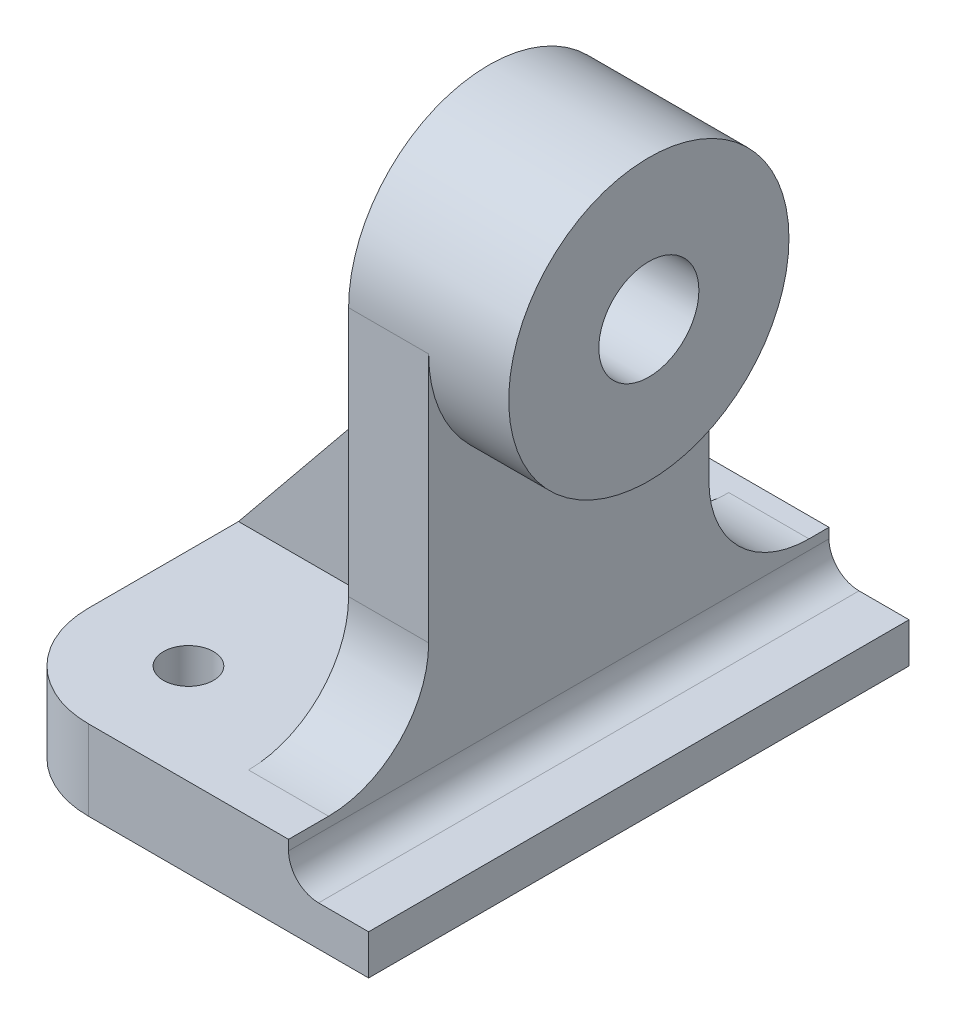
ISO-10303-21;
HEADER;
FILE_DESCRIPTION(('STEP AP214'),'2;1');
FILE_NAME('part.step','',(''),(''),'','','');
FILE_SCHEMA(('AUTOMOTIVE_DESIGN { 1 0 10303 214 1 1 1 1 }'));
ENDSEC;
DATA;
#1=APPLICATION_CONTEXT('core data for automotive mechanical design processes');
#2=APPLICATION_PROTOCOL_DEFINITION('international standard','automotive_design',2000,#1);
#3=PRODUCT_CONTEXT('',#1,'mechanical');
#4=PRODUCT('Part','Part','',(#3));
#5=PRODUCT_RELATED_PRODUCT_CATEGORY('part','',(#4));
#6=PRODUCT_DEFINITION_FORMATION('','',#4);
#7=PRODUCT_DEFINITION_CONTEXT('part definition',#1,'design');
#8=PRODUCT_DEFINITION('design','',#6,#7);
#9=PRODUCT_DEFINITION_SHAPE('','',#8);
#10=(LENGTH_UNIT() NAMED_UNIT(*) SI_UNIT(.MILLI.,.METRE.));
#11=(NAMED_UNIT(*) PLANE_ANGLE_UNIT() SI_UNIT($,.RADIAN.));
#12=(NAMED_UNIT(*) SI_UNIT($,.STERADIAN.) SOLID_ANGLE_UNIT());
#13=UNCERTAINTY_MEASURE_WITH_UNIT(LENGTH_MEASURE(1.E-05),#10,'distance_accuracy_value','');
#14=(GEOMETRIC_REPRESENTATION_CONTEXT(3) GLOBAL_UNCERTAINTY_ASSIGNED_CONTEXT((#13)) GLOBAL_UNIT_ASSIGNED_CONTEXT((#10,
#11,#12)) REPRESENTATION_CONTEXT('',''));
#15=CARTESIAN_POINT('',(0.,0.,0.));
#16=DIRECTION('',(0.,0.,1.));
#17=DIRECTION('',(1.,0.,0.));
#18=AXIS2_PLACEMENT_3D('',#15,#16,#17);
#19=CARTESIAN_POINT('',(0.,8.,0.));
#20=DIRECTION('',(0.,1.,0.));
#21=DIRECTION('',(0.,0.,1.));
#22=AXIS2_PLACEMENT_3D('',#19,#20,#21);
#23=PLANE('',#22);
#24=CARTESIAN_POINT('',(-28.,8.,-44.));
#25=DIRECTION('',(0.,1.,0.));
#26=DIRECTION('',(0.,0.,1.));
#27=AXIS2_PLACEMENT_3D('',#24,#25,#26);
#28=CIRCLE('',#27,2.5);
#29=CARTESIAN_POINT('',(-28.,8.,-41.5));
#30=VERTEX_POINT('',#29);
#31=EDGE_CURVE('E258',#30,#30,#28,.T.);
#32=ORIENTED_EDGE('',*,*,#31,.F.);
#33=EDGE_LOOP('',(#32));
#34=FACE_BOUND('',#33,.T.);
#35=DIRECTION('',(0.,0.,1.));
#36=VECTOR('',#35,1.);
#37=CARTESIAN_POINT('',(-38.,8.,0.));
#38=LINE('',#37,#36);
#39=CARTESIAN_POINT('',(-38.,8.,-44.));
#40=VERTEX_POINT('',#39);
#41=CARTESIAN_POINT('',(-38.,8.,-31.));
#42=VERTEX_POINT('',#41);
#43=EDGE_CURVE('E187',#40,#42,#38,.T.);
#44=ORIENTED_EDGE('',*,*,#43,.T.);
#45=DIRECTION('',(1.,0.,0.));
#46=VECTOR('',#45,1.);
#47=CARTESIAN_POINT('',(0.,8.,-31.));
#48=LINE('',#47,#46);
#49=CARTESIAN_POINT('',(-16.,8.,-31.));
#50=VERTEX_POINT('',#49);
#51=EDGE_CURVE('E186',#42,#50,#48,.T.);
#52=ORIENTED_EDGE('',*,*,#51,.T.);
#53=DIRECTION('',(0.,0.,-1.));
#54=VECTOR('',#53,1.);
#55=CARTESIAN_POINT('',(-16.,8.,-14.));
#56=LINE('',#55,#54);
#57=CARTESIAN_POINT('',(-16.,8.,-52.));
#58=VERTEX_POINT('',#57);
#59=EDGE_CURVE('E169',#50,#58,#56,.T.);
#60=ORIENTED_EDGE('',*,*,#59,.T.);
#61=DIRECTION('',(1.,0.,0.));
#62=VECTOR('',#61,1.);
#63=CARTESIAN_POINT('',(-8.,8.,-52.));
#64=LINE('',#63,#62);
#65=CARTESIAN_POINT('',(-8.,8.,-52.));
#66=VERTEX_POINT('',#65);
#67=EDGE_CURVE('E367',#58,#66,#64,.T.);
#68=ORIENTED_EDGE('',*,*,#67,.T.);
#69=DIRECTION('',(0.,0.,1.));
#70=VECTOR('',#69,1.);
#71=CARTESIAN_POINT('',(-8.,8.,-54.));
#72=LINE('',#71,#70);
#73=CARTESIAN_POINT('',(-8.,8.,-54.));
#74=VERTEX_POINT('',#73);
#75=EDGE_CURVE('E284',#74,#66,#72,.T.);
#76=ORIENTED_EDGE('',*,*,#75,.F.);
#77=DIRECTION('',(-1.,0.,0.));
#78=VECTOR('',#77,1.);
#79=CARTESIAN_POINT('',(0.,8.,-54.));
#80=LINE('',#79,#78);
#81=CARTESIAN_POINT('',(-28.,8.,-54.));
#82=VERTEX_POINT('',#81);
#83=EDGE_CURVE('E292',#74,#82,#80,.T.);
#84=ORIENTED_EDGE('',*,*,#83,.T.);
#85=CARTESIAN_POINT('',(-28.,8.,-44.));
#86=DIRECTION('',(0.,1.,0.));
#87=DIRECTION('',(0.,0.,1.));
#88=AXIS2_PLACEMENT_3D('',#85,#86,#87);
#89=CIRCLE('',#88,10.);
#90=EDGE_CURVE('E356',#82,#40,#89,.T.);
#91=ORIENTED_EDGE('',*,*,#90,.T.);
#92=EDGE_LOOP('',(#44,#52,#60,#68,#76,#84,#91));
#93=FACE_BOUND('',#92,.T.);
#94=ADVANCED_FACE('F43',(#34,#93),#23,.T.);
#95=CARTESIAN_POINT('',(-8.,4.,-54.));
#96=DIRECTION('',(1.,0.,0.));
#97=DIRECTION('',(0.,0.,-1.));
#98=AXIS2_PLACEMENT_3D('',#95,#96,#97);
#99=PLANE('',#98);
#100=DIRECTION('',(0.,0.,1.));
#101=VECTOR('',#100,1.);
#102=CARTESIAN_POINT('',(-8.,7.,-54.));
#103=LINE('',#102,#101);
#104=CARTESIAN_POINT('',(-8.,7.,0.));
#105=VERTEX_POINT('',#104);
#106=CARTESIAN_POINT('',(-8.,7.,-54.));
#107=VERTEX_POINT('',#106);
#108=EDGE_CURVE('E326',#105,#107,#103,.F.);
#109=ORIENTED_EDGE('',*,*,#108,.T.);
#110=DIRECTION('',(0.,1.,0.));
#111=VECTOR('',#110,1.);
#112=CARTESIAN_POINT('',(-8.,4.,-54.));
#113=LINE('',#112,#111);
#114=EDGE_CURVE('E273',#107,#74,#113,.T.);
#115=ORIENTED_EDGE('',*,*,#114,.T.);
#116=ORIENTED_EDGE('',*,*,#75,.T.);
#117=CARTESIAN_POINT('',(-8.,18.,-52.));
#118=DIRECTION('',(1.,0.,0.));
#119=DIRECTION('',(0.,0.,-1.));
#120=AXIS2_PLACEMENT_3D('',#117,#118,#119);
#121=CIRCLE('',#120,10.);
#122=CARTESIAN_POINT('',(-8.,18.,-42.));
#123=VERTEX_POINT('',#122);
#124=EDGE_CURVE('E377',#66,#123,#121,.F.);
#125=ORIENTED_EDGE('',*,*,#124,.T.);
#126=DIRECTION('',(0.,1.,0.));
#127=VECTOR('',#126,1.);
#128=CARTESIAN_POINT('',(-8.,43.,-42.));
#129=LINE('',#128,#127);
#130=CARTESIAN_POINT('',(-8.,43.,-42.));
#131=VERTEX_POINT('',#130);
#132=EDGE_CURVE('E230',#123,#131,#129,.T.);
#133=ORIENTED_EDGE('',*,*,#132,.T.);
#134=CARTESIAN_POINT('',(-8.,43.,-28.));
#135=DIRECTION('',(1.,0.,0.));
#136=DIRECTION('',(0.,0.,-1.));
#137=AXIS2_PLACEMENT_3D('',#134,#135,#136);
#138=CIRCLE('',#137,14.);
#139=CARTESIAN_POINT('',(-8.,43.,-14.));
#140=VERTEX_POINT('',#139);
#141=EDGE_CURVE('E218',#140,#131,#138,.T.);
#142=ORIENTED_EDGE('',*,*,#141,.F.);
#143=DIRECTION('',(0.,-1.,0.));
#144=VECTOR('',#143,1.);
#145=CARTESIAN_POINT('',(-8.,43.,-14.));
#146=LINE('',#145,#144);
#147=CARTESIAN_POINT('',(-8.,18.,-14.));
#148=VERTEX_POINT('',#147);
#149=EDGE_CURVE('E223',#140,#148,#146,.T.);
#150=ORIENTED_EDGE('',*,*,#149,.T.);
#151=CARTESIAN_POINT('',(-8.,18.,-4.));
#152=DIRECTION('',(1.,0.,0.));
#153=DIRECTION('',(0.,0.,-1.));
#154=AXIS2_PLACEMENT_3D('',#151,#152,#153);
#155=CIRCLE('',#154,10.);
#156=CARTESIAN_POINT('',(-8.,8.,-4.));
#157=VERTEX_POINT('',#156);
#158=EDGE_CURVE('E52',#148,#157,#155,.F.);
#159=ORIENTED_EDGE('',*,*,#158,.T.);
#160=CARTESIAN_POINT('',(-8.,8.,0.));
#161=VERTEX_POINT('',#160);
#162=EDGE_CURVE('E277',#157,#161,#72,.T.);
#163=ORIENTED_EDGE('',*,*,#162,.T.);
#164=DIRECTION('',(0.,1.,0.));
#165=VECTOR('',#164,1.);
#166=CARTESIAN_POINT('',(-8.,4.,0.));
#167=LINE('',#166,#165);
#168=EDGE_CURVE('E274',#105,#161,#167,.T.);
#169=ORIENTED_EDGE('',*,*,#168,.F.);
#170=EDGE_LOOP('',(#109,#115,#116,#125,#133,#142,#150,#159,#163,#169));
#171=FACE_BOUND('',#170,.T.);
#172=ADVANCED_FACE('F384',(#171),#99,.T.);
#173=CARTESIAN_POINT('',(0.,8.,0.));
#174=DIRECTION('',(-1.,0.,0.));
#175=DIRECTION('',(0.,0.,1.));
#176=AXIS2_PLACEMENT_3D('',#173,#174,#175);
#177=PLANE('',#176);
#178=DIRECTION('',(0.,0.,-1.));
#179=VECTOR('',#178,1.);
#180=CARTESIAN_POINT('',(0.,0.,0.));
#181=LINE('',#180,#179);
#182=CARTESIAN_POINT('',(0.,0.,0.));
#183=VERTEX_POINT('',#182);
#184=CARTESIAN_POINT('',(0.,0.,-54.));
#185=VERTEX_POINT('',#184);
#186=EDGE_CURVE('E291',#183,#185,#181,.T.);
#187=ORIENTED_EDGE('',*,*,#186,.T.);
#188=DIRECTION('',(0.,-1.,0.));
#189=VECTOR('',#188,1.);
#190=CARTESIAN_POINT('',(0.,8.,-54.));
#191=LINE('',#190,#189);
#192=CARTESIAN_POINT('',(0.,4.,-54.));
#193=VERTEX_POINT('',#192);
#194=EDGE_CURVE('E319',#193,#185,#191,.T.);
#195=ORIENTED_EDGE('',*,*,#194,.F.);
#196=DIRECTION('',(0.,0.,1.));
#197=VECTOR('',#196,1.);
#198=CARTESIAN_POINT('',(0.,4.,-54.));
#199=LINE('',#198,#197);
#200=CARTESIAN_POINT('',(0.,4.,0.));
#201=VERTEX_POINT('',#200);
#202=EDGE_CURVE('E288',#193,#201,#199,.T.);
#203=ORIENTED_EDGE('',*,*,#202,.T.);
#204=DIRECTION('',(0.,-1.,0.));
#205=VECTOR('',#204,1.);
#206=CARTESIAN_POINT('',(0.,8.,0.));
#207=LINE('',#206,#205);
#208=EDGE_CURVE('E304',#201,#183,#207,.T.);
#209=ORIENTED_EDGE('',*,*,#208,.T.);
#210=EDGE_LOOP('',(#187,#195,#203,#209));
#211=FACE_BOUND('',#210,.T.);
#212=ADVANCED_FACE('F428',(#211),#177,.F.);
#213=CARTESIAN_POINT('',(0.,8.,-54.));
#214=DIRECTION('',(0.,0.,1.));
#215=DIRECTION('',(1.,0.,0.));
#216=AXIS2_PLACEMENT_3D('',#213,#214,#215);
#217=PLANE('',#216);
#218=DIRECTION('',(-1.,0.,0.));
#219=VECTOR('',#218,1.);
#220=CARTESIAN_POINT('',(0.,0.,-54.));
#221=LINE('',#220,#219);
#222=CARTESIAN_POINT('',(-28.,0.,-54.));
#223=VERTEX_POINT('',#222);
#224=EDGE_CURVE('E307',#185,#223,#221,.T.);
#225=ORIENTED_EDGE('',*,*,#224,.T.);
#226=DIRECTION('',(0.,-1.,0.));
#227=VECTOR('',#226,1.);
#228=CARTESIAN_POINT('',(-28.,8.,-54.));
#229=LINE('',#228,#227);
#230=EDGE_CURVE('E350',#223,#82,#229,.F.);
#231=ORIENTED_EDGE('',*,*,#230,.T.);
#232=ORIENTED_EDGE('',*,*,#83,.F.);
#233=ORIENTED_EDGE('',*,*,#114,.F.);
#234=CARTESIAN_POINT('',(-5.,7.,-54.));
#235=DIRECTION('',(0.,0.,1.));
#236=DIRECTION('',(1.,0.,0.));
#237=AXIS2_PLACEMENT_3D('',#234,#235,#236);
#238=CIRCLE('',#237,3.);
#239=CARTESIAN_POINT('',(-5.,4.,-54.));
#240=VERTEX_POINT('',#239);
#241=EDGE_CURVE('E332',#107,#240,#238,.T.);
#242=ORIENTED_EDGE('',*,*,#241,.T.);
#243=DIRECTION('',(-1.,0.,0.));
#244=VECTOR('',#243,1.);
#245=CARTESIAN_POINT('',(0.,4.,-54.));
#246=LINE('',#245,#244);
#247=EDGE_CURVE('E269',#193,#240,#246,.T.);
#248=ORIENTED_EDGE('',*,*,#247,.F.);
#249=ORIENTED_EDGE('',*,*,#194,.T.);
#250=EDGE_LOOP('',(#225,#231,#232,#233,#242,#248,#249));
#251=FACE_BOUND('',#250,.T.);
#252=ADVANCED_FACE('F415',(#251),#217,.F.);
#253=CARTESIAN_POINT('',(0.,8.,0.));
#254=DIRECTION('',(0.,0.,-1.));
#255=DIRECTION('',(-1.,0.,0.));
#256=AXIS2_PLACEMENT_3D('',#253,#254,#255);
#257=PLANE('',#256);
#258=DIRECTION('',(1.,0.,0.));
#259=VECTOR('',#258,1.);
#260=CARTESIAN_POINT('',(0.,8.,0.));
#261=LINE('',#260,#259);
#262=CARTESIAN_POINT('',(-28.,8.,0.));
#263=VERTEX_POINT('',#262);
#264=EDGE_CURVE('E300',#263,#161,#261,.T.);
#265=ORIENTED_EDGE('',*,*,#264,.F.);
#266=DIRECTION('',(0.,-1.,0.));
#267=VECTOR('',#266,1.);
#268=CARTESIAN_POINT('',(-28.,8.,0.));
#269=LINE('',#268,#267);
#270=CARTESIAN_POINT('',(-28.,0.,0.));
#271=VERTEX_POINT('',#270);
#272=EDGE_CURVE('E359',#263,#271,#269,.T.);
#273=ORIENTED_EDGE('',*,*,#272,.T.);
#274=DIRECTION('',(1.,0.,0.));
#275=VECTOR('',#274,1.);
#276=CARTESIAN_POINT('',(0.,0.,0.));
#277=LINE('',#276,#275);
#278=EDGE_CURVE('E297',#271,#183,#277,.T.);
#279=ORIENTED_EDGE('',*,*,#278,.T.);
#280=ORIENTED_EDGE('',*,*,#208,.F.);
#281=DIRECTION('',(-1.,0.,0.));
#282=VECTOR('',#281,1.);
#283=CARTESIAN_POINT('',(0.,4.,0.));
#284=LINE('',#283,#282);
#285=CARTESIAN_POINT('',(-5.,4.,0.));
#286=VERTEX_POINT('',#285);
#287=EDGE_CURVE('E257',#201,#286,#284,.T.);
#288=ORIENTED_EDGE('',*,*,#287,.T.);
#289=CARTESIAN_POINT('',(-5.,7.,0.));
#290=DIRECTION('',(0.,0.,-1.));
#291=DIRECTION('',(-1.,0.,0.));
#292=AXIS2_PLACEMENT_3D('',#289,#290,#291);
#293=CIRCLE('',#292,3.);
#294=EDGE_CURVE('E329',#286,#105,#293,.T.);
#295=ORIENTED_EDGE('',*,*,#294,.T.);
#296=ORIENTED_EDGE('',*,*,#168,.T.);
#297=EDGE_LOOP('',(#265,#273,#279,#280,#288,#295,#296));
#298=FACE_BOUND('',#297,.T.);
#299=ADVANCED_FACE('F477',(#298),#257,.F.);
#300=DIRECTION('',(1.,0.,0.));
#301=VECTOR('',#300,1.);
#302=CARTESIAN_POINT('',(0.,8.,-25.));
#303=LINE('',#302,#301);
#304=CARTESIAN_POINT('',(-38.,8.,-25.));
#305=VERTEX_POINT('',#304);
#306=CARTESIAN_POINT('',(-16.,8.,-25.));
#307=VERTEX_POINT('',#306);
#308=EDGE_CURVE('E59',#305,#307,#303,.T.);
#309=ORIENTED_EDGE('',*,*,#308,.F.);
#310=CARTESIAN_POINT('',(-38.,8.,-10.));
#311=VERTEX_POINT('',#310);
#312=EDGE_CURVE('E296',#305,#311,#38,.T.);
#313=ORIENTED_EDGE('',*,*,#312,.T.);
#314=CARTESIAN_POINT('',(-28.,8.,-10.));
#315=DIRECTION('',(0.,1.,0.));
#316=DIRECTION('',(0.,0.,1.));
#317=AXIS2_PLACEMENT_3D('',#314,#315,#316);
#318=CIRCLE('',#317,10.);
#319=EDGE_CURVE('E353',#311,#263,#318,.T.);
#320=ORIENTED_EDGE('',*,*,#319,.T.);
#321=ORIENTED_EDGE('',*,*,#264,.T.);
#322=ORIENTED_EDGE('',*,*,#162,.F.);
#323=DIRECTION('',(1.,0.,0.));
#324=VECTOR('',#323,1.);
#325=CARTESIAN_POINT('',(-16.,8.,-4.));
#326=LINE('',#325,#324);
#327=CARTESIAN_POINT('',(-16.,8.,-4.));
#328=VERTEX_POINT('',#327);
#329=EDGE_CURVE('E363',#157,#328,#326,.F.);
#330=ORIENTED_EDGE('',*,*,#329,.T.);
#331=EDGE_CURVE('E182',#328,#307,#56,.T.);
#332=ORIENTED_EDGE('',*,*,#331,.T.);
#333=EDGE_LOOP('',(#309,#313,#320,#321,#322,#330,#332));
#334=FACE_BOUND('',#333,.T.);
#335=CARTESIAN_POINT('',(-28.,8.,-10.));
#336=DIRECTION('',(0.,1.,0.));
#337=DIRECTION('',(0.,0.,1.));
#338=AXIS2_PLACEMENT_3D('',#335,#336,#337);
#339=CIRCLE('',#338,2.5);
#340=CARTESIAN_POINT('',(-28.,8.,-7.5));
#341=VERTEX_POINT('',#340);
#342=EDGE_CURVE('E262',#341,#341,#339,.T.);
#343=ORIENTED_EDGE('',*,*,#342,.F.);
#344=EDGE_LOOP('',(#343));
#345=FACE_BOUND('',#344,.T.);
#346=ADVANCED_FACE('F390',(#334,#345),#23,.T.);
#347=CARTESIAN_POINT('',(-38.,8.,0.));
#348=DIRECTION('',(1.,0.,0.));
#349=DIRECTION('',(0.,0.,-1.));
#350=AXIS2_PLACEMENT_3D('',#347,#348,#349);
#351=PLANE('',#350);
#352=ORIENTED_EDGE('',*,*,#312,.F.);
#353=DIRECTION('',(0.,0.,-1.));
#354=VECTOR('',#353,1.);
#355=CARTESIAN_POINT('',(-38.,8.,0.));
#356=LINE('',#355,#354);
#357=EDGE_CURVE('E66',#42,#305,#356,.F.);
#358=ORIENTED_EDGE('',*,*,#357,.F.);
#359=ORIENTED_EDGE('',*,*,#43,.F.);
#360=DIRECTION('',(0.,-1.,0.));
#361=VECTOR('',#360,1.);
#362=CARTESIAN_POINT('',(-38.,8.,-44.));
#363=LINE('',#362,#361);
#364=CARTESIAN_POINT('',(-38.,0.,-44.));
#365=VERTEX_POINT('',#364);
#366=EDGE_CURVE('E339',#40,#365,#363,.T.);
#367=ORIENTED_EDGE('',*,*,#366,.T.);
#368=DIRECTION('',(0.,0.,1.));
#369=VECTOR('',#368,1.);
#370=CARTESIAN_POINT('',(-38.,0.,0.));
#371=LINE('',#370,#369);
#372=CARTESIAN_POINT('',(-38.,0.,-10.));
#373=VERTEX_POINT('',#372);
#374=EDGE_CURVE('E311',#365,#373,#371,.T.);
#375=ORIENTED_EDGE('',*,*,#374,.T.);
#376=DIRECTION('',(0.,-1.,0.));
#377=VECTOR('',#376,1.);
#378=CARTESIAN_POINT('',(-38.,8.,-10.));
#379=LINE('',#378,#377);
#380=EDGE_CURVE('E335',#373,#311,#379,.F.);
#381=ORIENTED_EDGE('',*,*,#380,.T.);
#382=EDGE_LOOP('',(#352,#358,#359,#367,#375,#381));
#383=FACE_BOUND('',#382,.T.);
#384=ADVANCED_FACE('F440',(#383),#351,.F.);
#385=CARTESIAN_POINT('',(0.,0.,0.));
#386=DIRECTION('',(0.,1.,0.));
#387=DIRECTION('',(0.,0.,1.));
#388=AXIS2_PLACEMENT_3D('',#385,#386,#387);
#389=PLANE('',#388);
#390=CARTESIAN_POINT('',(-28.,0.,-10.));
#391=DIRECTION('',(0.,1.,0.));
#392=DIRECTION('',(0.,0.,1.));
#393=AXIS2_PLACEMENT_3D('',#390,#391,#392);
#394=CIRCLE('',#393,2.5);
#395=CARTESIAN_POINT('',(-28.,0.,-7.5));
#396=VERTEX_POINT('',#395);
#397=EDGE_CURVE('E249',#396,#396,#394,.T.);
#398=ORIENTED_EDGE('',*,*,#397,.T.);
#399=EDGE_LOOP('',(#398));
#400=FACE_BOUND('',#399,.T.);
#401=CARTESIAN_POINT('',(-28.,0.,-10.));
#402=DIRECTION('',(0.,1.,0.));
#403=DIRECTION('',(0.,0.,1.));
#404=AXIS2_PLACEMENT_3D('',#401,#402,#403);
#405=CIRCLE('',#404,10.);
#406=EDGE_CURVE('E343',#271,#373,#405,.F.);
#407=ORIENTED_EDGE('',*,*,#406,.T.);
#408=ORIENTED_EDGE('',*,*,#374,.F.);
#409=CARTESIAN_POINT('',(-28.,0.,-44.));
#410=DIRECTION('',(0.,1.,0.));
#411=DIRECTION('',(0.,0.,1.));
#412=AXIS2_PLACEMENT_3D('',#409,#410,#411);
#413=CIRCLE('',#412,10.);
#414=EDGE_CURVE('E347',#365,#223,#413,.F.);
#415=ORIENTED_EDGE('',*,*,#414,.T.);
#416=ORIENTED_EDGE('',*,*,#224,.F.);
#417=ORIENTED_EDGE('',*,*,#186,.F.);
#418=ORIENTED_EDGE('',*,*,#278,.F.);
#419=EDGE_LOOP('',(#407,#408,#415,#416,#417,#418));
#420=FACE_BOUND('',#419,.T.);
#421=CARTESIAN_POINT('',(-28.,0.,-44.));
#422=DIRECTION('',(0.,1.,0.));
#423=DIRECTION('',(0.,0.,1.));
#424=AXIS2_PLACEMENT_3D('',#421,#422,#423);
#425=CIRCLE('',#424,2.5);
#426=CARTESIAN_POINT('',(-28.,0.,-41.5));
#427=VERTEX_POINT('',#426);
#428=EDGE_CURVE('E253',#427,#427,#425,.T.);
#429=ORIENTED_EDGE('',*,*,#428,.T.);
#430=EDGE_LOOP('',(#429));
#431=FACE_BOUND('',#430,.T.);
#432=ADVANCED_FACE('F432',(#400,#420,#431),#389,.F.);
#433=CARTESIAN_POINT('',(0.,4.,-54.));
#434=DIRECTION('',(0.,1.,0.));
#435=DIRECTION('',(-1.,0.,0.));
#436=AXIS2_PLACEMENT_3D('',#433,#434,#435);
#437=PLANE('',#436);
#438=ORIENTED_EDGE('',*,*,#287,.F.);
#439=ORIENTED_EDGE('',*,*,#202,.F.);
#440=ORIENTED_EDGE('',*,*,#247,.T.);
#441=DIRECTION('',(0.,0.,1.));
#442=VECTOR('',#441,1.);
#443=CARTESIAN_POINT('',(-5.,4.,0.));
#444=LINE('',#443,#442);
#445=EDGE_CURVE('E323',#240,#286,#444,.T.);
#446=ORIENTED_EDGE('',*,*,#445,.T.);
#447=EDGE_LOOP('',(#438,#439,#440,#446));
#448=FACE_BOUND('',#447,.T.);
#449=ADVANCED_FACE('F423',(#448),#437,.T.);
#450=CARTESIAN_POINT('',(-5.,7.,-54.));
#451=DIRECTION('',(0.,0.,-1.));
#452=DIRECTION('',(-1.,0.,0.));
#453=AXIS2_PLACEMENT_3D('',#450,#451,#452);
#454=CYLINDRICAL_SURFACE('',#453,3.);
#455=ORIENTED_EDGE('',*,*,#294,.F.);
#456=ORIENTED_EDGE('',*,*,#445,.F.);
#457=ORIENTED_EDGE('',*,*,#241,.F.);
#458=ORIENTED_EDGE('',*,*,#108,.F.);
#459=EDGE_LOOP('',(#455,#456,#457,#458));
#460=FACE_BOUND('',#459,.T.);
#461=ADVANCED_FACE('F420',(#460),#454,.F.);
#462=CARTESIAN_POINT('',(-28.,8.,-44.));
#463=DIRECTION('',(0.,-1.,0.));
#464=DIRECTION('',(0.,0.,-1.));
#465=AXIS2_PLACEMENT_3D('',#462,#463,#464);
#466=CYLINDRICAL_SURFACE('',#465,10.);
#467=ORIENTED_EDGE('',*,*,#90,.F.);
#468=ORIENTED_EDGE('',*,*,#230,.F.);
#469=ORIENTED_EDGE('',*,*,#414,.F.);
#470=ORIENTED_EDGE('',*,*,#366,.F.);
#471=EDGE_LOOP('',(#467,#468,#469,#470));
#472=FACE_BOUND('',#471,.T.);
#473=ADVANCED_FACE('F438',(#472),#466,.T.);
#474=CARTESIAN_POINT('',(-28.,8.,-10.));
#475=DIRECTION('',(0.,-1.,0.));
#476=DIRECTION('',(0.,0.,-1.));
#477=AXIS2_PLACEMENT_3D('',#474,#475,#476);
#478=CYLINDRICAL_SURFACE('',#477,10.);
#479=ORIENTED_EDGE('',*,*,#319,.F.);
#480=ORIENTED_EDGE('',*,*,#380,.F.);
#481=ORIENTED_EDGE('',*,*,#406,.F.);
#482=ORIENTED_EDGE('',*,*,#272,.F.);
#483=EDGE_LOOP('',(#479,#480,#481,#482));
#484=FACE_BOUND('',#483,.T.);
#485=ADVANCED_FACE('F445',(#484),#478,.T.);
#486=CARTESIAN_POINT('',(-28.,0.,-10.));
#487=DIRECTION('',(0.,1.,0.));
#488=DIRECTION('',(0.,0.,1.));
#489=AXIS2_PLACEMENT_3D('',#486,#487,#488);
#490=CYLINDRICAL_SURFACE('',#489,2.5);
#491=ORIENTED_EDGE('',*,*,#397,.F.);
#492=EDGE_LOOP('',(#491));
#493=FACE_BOUND('',#492,.T.);
#494=ORIENTED_EDGE('',*,*,#342,.T.);
#495=EDGE_LOOP('',(#494));
#496=FACE_BOUND('',#495,.T.);
#497=ADVANCED_FACE('F497',(#493,#496),#490,.F.);
#498=CARTESIAN_POINT('',(-28.,0.,-44.));
#499=DIRECTION('',(0.,1.,0.));
#500=DIRECTION('',(0.,0.,1.));
#501=AXIS2_PLACEMENT_3D('',#498,#499,#500);
#502=CYLINDRICAL_SURFACE('',#501,2.5);
#503=ORIENTED_EDGE('',*,*,#428,.F.);
#504=EDGE_LOOP('',(#503));
#505=FACE_BOUND('',#504,.T.);
#506=ORIENTED_EDGE('',*,*,#31,.T.);
#507=EDGE_LOOP('',(#506));
#508=FACE_BOUND('',#507,.T.);
#509=ADVANCED_FACE('F517',(#505,#508),#502,.F.);
#510=CARTESIAN_POINT('',(-16.,43.,-28.));
#511=DIRECTION('',(1.,0.,0.));
#512=DIRECTION('',(0.,0.,-1.));
#513=AXIS2_PLACEMENT_3D('',#510,#511,#512);
#514=CYLINDRICAL_SURFACE('',#513,14.);
#515=ORIENTED_EDGE('',*,*,#141,.T.);
#516=DIRECTION('',(1.,0.,0.));
#517=VECTOR('',#516,1.);
#518=CARTESIAN_POINT('',(-16.,43.,-42.));
#519=LINE('',#518,#517);
#520=CARTESIAN_POINT('',(-16.,43.,-42.));
#521=VERTEX_POINT('',#520);
#522=EDGE_CURVE('E245',#521,#131,#519,.T.);
#523=ORIENTED_EDGE('',*,*,#522,.F.);
#524=CARTESIAN_POINT('',(-16.,43.,-28.));
#525=DIRECTION('',(1.,0.,0.));
#526=DIRECTION('',(0.,0.,-1.));
#527=AXIS2_PLACEMENT_3D('',#524,#525,#526);
#528=CIRCLE('',#527,14.);
#529=CARTESIAN_POINT('',(-16.,43.,-14.));
#530=VERTEX_POINT('',#529);
#531=EDGE_CURVE('E226',#521,#530,#528,.T.);
#532=ORIENTED_EDGE('',*,*,#531,.T.);
#533=DIRECTION('',(1.,0.,0.));
#534=VECTOR('',#533,1.);
#535=CARTESIAN_POINT('',(-16.,43.,-14.));
#536=LINE('',#535,#534);
#537=EDGE_CURVE('E238',#530,#140,#536,.T.);
#538=ORIENTED_EDGE('',*,*,#537,.T.);
#539=EDGE_LOOP('',(#515,#523,#532,#538));
#540=FACE_BOUND('',#539,.T.);
#541=CARTESIAN_POINT('',(0.,43.,-28.));
#542=DIRECTION('',(1.,0.,0.));
#543=DIRECTION('',(0.,0.,-1.));
#544=AXIS2_PLACEMENT_3D('',#541,#542,#543);
#545=CIRCLE('',#544,14.);
#546=CARTESIAN_POINT('',(0.,43.,-42.));
#547=VERTEX_POINT('',#546);
#548=EDGE_CURVE('E219',#547,#547,#545,.T.);
#549=ORIENTED_EDGE('',*,*,#548,.F.);
#550=EDGE_LOOP('',(#549));
#551=FACE_BOUND('',#550,.T.);
#552=ADVANCED_FACE('F400',(#540,#551),#514,.T.);
#553=CARTESIAN_POINT('',(-16.,43.,-42.));
#554=DIRECTION('',(0.,0.,-1.));
#555=DIRECTION('',(0.,1.,0.));
#556=AXIS2_PLACEMENT_3D('',#553,#554,#555);
#557=PLANE('',#556);
#558=ORIENTED_EDGE('',*,*,#132,.F.);
#559=DIRECTION('',(1.,0.,0.));
#560=VECTOR('',#559,1.);
#561=CARTESIAN_POINT('',(-16.,18.,-42.));
#562=LINE('',#561,#560);
#563=CARTESIAN_POINT('',(-16.,18.,-42.));
#564=VERTEX_POINT('',#563);
#565=EDGE_CURVE('E370',#123,#564,#562,.F.);
#566=ORIENTED_EDGE('',*,*,#565,.T.);
#567=DIRECTION('',(0.,1.,0.));
#568=VECTOR('',#567,1.);
#569=CARTESIAN_POINT('',(-16.,43.,-42.));
#570=LINE('',#569,#568);
#571=EDGE_CURVE('E235',#564,#521,#570,.T.);
#572=ORIENTED_EDGE('',*,*,#571,.T.);
#573=ORIENTED_EDGE('',*,*,#522,.T.);
#574=EDGE_LOOP('',(#558,#566,#572,#573));
#575=FACE_BOUND('',#574,.T.);
#576=ADVANCED_FACE('F406',(#575),#557,.T.);
#577=CARTESIAN_POINT('',(-16.,43.,-14.));
#578=DIRECTION('',(0.,0.,1.));
#579=DIRECTION('',(0.,-1.,0.));
#580=AXIS2_PLACEMENT_3D('',#577,#578,#579);
#581=PLANE('',#580);
#582=DIRECTION('',(0.,-1.,0.));
#583=VECTOR('',#582,1.);
#584=CARTESIAN_POINT('',(-16.,43.,-14.));
#585=LINE('',#584,#583);
#586=CARTESIAN_POINT('',(-16.,18.,-14.));
#587=VERTEX_POINT('',#586);
#588=EDGE_CURVE('E183',#530,#587,#585,.T.);
#589=ORIENTED_EDGE('',*,*,#588,.T.);
#590=DIRECTION('',(1.,0.,0.));
#591=VECTOR('',#590,1.);
#592=CARTESIAN_POINT('',(-8.,18.,-14.));
#593=LINE('',#592,#591);
#594=EDGE_CURVE('E373',#587,#148,#593,.T.);
#595=ORIENTED_EDGE('',*,*,#594,.T.);
#596=ORIENTED_EDGE('',*,*,#149,.F.);
#597=ORIENTED_EDGE('',*,*,#537,.F.);
#598=EDGE_LOOP('',(#589,#595,#596,#597));
#599=FACE_BOUND('',#598,.T.);
#600=ADVANCED_FACE('F398',(#599),#581,.T.);
#601=CARTESIAN_POINT('',(-16.,43.,-28.));
#602=DIRECTION('',(1.,0.,0.));
#603=DIRECTION('',(0.,0.,-1.));
#604=AXIS2_PLACEMENT_3D('',#601,#602,#603);
#605=PLANE('',#604);
#606=CARTESIAN_POINT('',(-16.,43.,-28.));
#607=DIRECTION('',(1.,0.,0.));
#608=DIRECTION('',(0.,0.,-1.));
#609=AXIS2_PLACEMENT_3D('',#606,#607,#608);
#610=CIRCLE('',#609,5.);
#611=CARTESIAN_POINT('',(-16.,43.,-33.));
#612=VERTEX_POINT('',#611);
#613=EDGE_CURVE('E214',#612,#612,#610,.T.);
#614=ORIENTED_EDGE('',*,*,#613,.T.);
#615=EDGE_LOOP('',(#614));
#616=FACE_BOUND('',#615,.T.);
#617=DIRECTION('',(0.,0.,-1.));
#618=VECTOR('',#617,1.);
#619=CARTESIAN_POINT('',(-16.,35.,-28.));
#620=LINE('',#619,#618);
#621=CARTESIAN_POINT('',(-16.,35.,-31.));
#622=VERTEX_POINT('',#621);
#623=CARTESIAN_POINT('',(-16.,35.,-25.));
#624=VERTEX_POINT('',#623);
#625=EDGE_CURVE('E205',#622,#624,#620,.F.);
#626=ORIENTED_EDGE('',*,*,#625,.T.);
#627=DIRECTION('',(0.,-1.,0.));
#628=VECTOR('',#627,1.);
#629=CARTESIAN_POINT('',(-16.,43.,-25.));
#630=LINE('',#629,#628);
#631=EDGE_CURVE('E199',#624,#307,#630,.T.);
#632=ORIENTED_EDGE('',*,*,#631,.T.);
#633=ORIENTED_EDGE('',*,*,#331,.F.);
#634=CARTESIAN_POINT('',(-16.,18.,-4.));
#635=DIRECTION('',(1.,0.,0.));
#636=DIRECTION('',(0.,0.,-1.));
#637=AXIS2_PLACEMENT_3D('',#634,#635,#636);
#638=CIRCLE('',#637,10.);
#639=EDGE_CURVE('E11',#328,#587,#638,.T.);
#640=ORIENTED_EDGE('',*,*,#639,.T.);
#641=ORIENTED_EDGE('',*,*,#588,.F.);
#642=ORIENTED_EDGE('',*,*,#531,.F.);
#643=ORIENTED_EDGE('',*,*,#571,.F.);
#644=CARTESIAN_POINT('',(-16.,18.,-52.));
#645=DIRECTION('',(1.,0.,0.));
#646=DIRECTION('',(0.,0.,-1.));
#647=AXIS2_PLACEMENT_3D('',#644,#645,#646);
#648=CIRCLE('',#647,10.);
#649=EDGE_CURVE('E177',#564,#58,#648,.T.);
#650=ORIENTED_EDGE('',*,*,#649,.T.);
#651=ORIENTED_EDGE('',*,*,#59,.F.);
#652=DIRECTION('',(0.,-1.,0.));
#653=VECTOR('',#652,1.);
#654=CARTESIAN_POINT('',(-16.,43.,-31.));
#655=LINE('',#654,#653);
#656=EDGE_CURVE('E173',#622,#50,#655,.T.);
#657=ORIENTED_EDGE('',*,*,#656,.F.);
#658=EDGE_LOOP('',(#626,#632,#633,#640,#641,#642,#643,#650,#651,#657));
#659=FACE_BOUND('',#658,.T.);
#660=ADVANCED_FACE('F171',(#616,#659),#605,.F.);
#661=CARTESIAN_POINT('',(0.,18.,-52.));
#662=DIRECTION('',(-1.,0.,0.));
#663=DIRECTION('',(0.,0.,1.));
#664=AXIS2_PLACEMENT_3D('',#661,#662,#663);
#665=CYLINDRICAL_SURFACE('',#664,10.);
#666=ORIENTED_EDGE('',*,*,#649,.F.);
#667=ORIENTED_EDGE('',*,*,#565,.F.);
#668=ORIENTED_EDGE('',*,*,#124,.F.);
#669=ORIENTED_EDGE('',*,*,#67,.F.);
#670=EDGE_LOOP('',(#666,#667,#668,#669));
#671=FACE_BOUND('',#670,.T.);
#672=ADVANCED_FACE('F408',(#671),#665,.F.);
#673=CARTESIAN_POINT('',(-16.,18.,-4.));
#674=DIRECTION('',(-1.,0.,0.));
#675=DIRECTION('',(0.,0.,1.));
#676=AXIS2_PLACEMENT_3D('',#673,#674,#675);
#677=CYLINDRICAL_SURFACE('',#676,10.);
#678=ORIENTED_EDGE('',*,*,#639,.F.);
#679=ORIENTED_EDGE('',*,*,#329,.F.);
#680=ORIENTED_EDGE('',*,*,#158,.F.);
#681=ORIENTED_EDGE('',*,*,#594,.F.);
#682=EDGE_LOOP('',(#678,#679,#680,#681));
#683=FACE_BOUND('',#682,.T.);
#684=ADVANCED_FACE('F45',(#683),#677,.F.);
#685=CARTESIAN_POINT('',(0.,43.,-28.));
#686=DIRECTION('',(1.,0.,0.));
#687=DIRECTION('',(0.,0.,-1.));
#688=AXIS2_PLACEMENT_3D('',#685,#686,#687);
#689=PLANE('',#688);
#690=CARTESIAN_POINT('',(0.,43.,-28.));
#691=DIRECTION('',(1.,0.,0.));
#692=DIRECTION('',(0.,0.,-1.));
#693=AXIS2_PLACEMENT_3D('',#690,#691,#692);
#694=CIRCLE('',#693,5.);
#695=CARTESIAN_POINT('',(0.,43.,-33.));
#696=VERTEX_POINT('',#695);
#697=EDGE_CURVE('E210',#696,#696,#694,.T.);
#698=ORIENTED_EDGE('',*,*,#697,.F.);
#699=EDGE_LOOP('',(#698));
#700=FACE_BOUND('',#699,.T.);
#701=ORIENTED_EDGE('',*,*,#548,.T.);
#702=EDGE_LOOP('',(#701));
#703=FACE_BOUND('',#702,.T.);
#704=ADVANCED_FACE('F503',(#700,#703),#689,.T.);
#705=CARTESIAN_POINT('',(-38.,43.,-28.));
#706=DIRECTION('',(1.,0.,0.));
#707=DIRECTION('',(0.,0.,-1.));
#708=AXIS2_PLACEMENT_3D('',#705,#706,#707);
#709=CYLINDRICAL_SURFACE('',#708,5.);
#710=ORIENTED_EDGE('',*,*,#697,.T.);
#711=EDGE_LOOP('',(#710));
#712=FACE_BOUND('',#711,.T.);
#713=ORIENTED_EDGE('',*,*,#613,.F.);
#714=EDGE_LOOP('',(#713));
#715=FACE_BOUND('',#714,.T.);
#716=ADVANCED_FACE('F464',(#712,#715),#709,.F.);
#717=CARTESIAN_POINT('',(-38.,8.,-28.));
#718=DIRECTION('',(0.775234985517289,-0.631672951162236,0.));
#719=DIRECTION('',(0.631672951162236,0.775234985517289,0.));
#720=AXIS2_PLACEMENT_3D('',#717,#718,#719);
#721=PLANE('',#720);
#722=DIRECTION('',(0.631672951162236,0.775234985517289,0.));
#723=VECTOR('',#722,1.);
#724=CARTESIAN_POINT('',(-38.,8.,-31.));
#725=LINE('',#724,#723);
#726=EDGE_CURVE('E195',#42,#622,#725,.T.);
#727=ORIENTED_EDGE('',*,*,#726,.F.);
#728=ORIENTED_EDGE('',*,*,#357,.T.);
#729=DIRECTION('',(0.631672951162236,0.775234985517289,0.));
#730=VECTOR('',#729,1.);
#731=CARTESIAN_POINT('',(-38.,8.,-25.));
#732=LINE('',#731,#730);
#733=EDGE_CURVE('E192',#305,#624,#732,.T.);
#734=ORIENTED_EDGE('',*,*,#733,.T.);
#735=ORIENTED_EDGE('',*,*,#625,.F.);
#736=EDGE_LOOP('',(#727,#728,#734,#735));
#737=FACE_BOUND('',#736,.T.);
#738=ADVANCED_FACE('F450',(#737),#721,.F.);
#739=CARTESIAN_POINT('',(-19.,28.5,-25.));
#740=DIRECTION('',(0.,0.,1.));
#741=DIRECTION('',(1.,0.,0.));
#742=AXIS2_PLACEMENT_3D('',#739,#740,#741);
#743=PLANE('',#742);
#744=ORIENTED_EDGE('',*,*,#631,.F.);
#745=ORIENTED_EDGE('',*,*,#733,.F.);
#746=ORIENTED_EDGE('',*,*,#308,.T.);
#747=EDGE_LOOP('',(#744,#745,#746));
#748=FACE_BOUND('',#747,.T.);
#749=ADVANCED_FACE('F453',(#748),#743,.T.);
#750=CARTESIAN_POINT('',(-19.,28.5,-31.));
#751=DIRECTION('',(0.,0.,1.));
#752=DIRECTION('',(1.,0.,0.));
#753=AXIS2_PLACEMENT_3D('',#750,#751,#752);
#754=PLANE('',#753);
#755=ORIENTED_EDGE('',*,*,#726,.T.);
#756=ORIENTED_EDGE('',*,*,#656,.T.);
#757=ORIENTED_EDGE('',*,*,#51,.F.);
#758=EDGE_LOOP('',(#755,#756,#757));
#759=FACE_BOUND('',#758,.T.);
#760=ADVANCED_FACE('F194',(#759),#754,.F.);
#761=CLOSED_SHELL('',(#94,#172,#212,#252,#299,#346,#384,#432,#449,#461,#473,#485,#497,#509,#552,
#576,#600,#660,#672,#684,#704,#716,#738,#749,#760));
#762=MANIFOLD_SOLID_BREP('B2',#761);
#763=ADVANCED_BREP_SHAPE_REPRESENTATION('',(#18,#762),#14);
#764=SHAPE_DEFINITION_REPRESENTATION(#9,#763);
ENDSEC;
END-ISO-10303-21;
